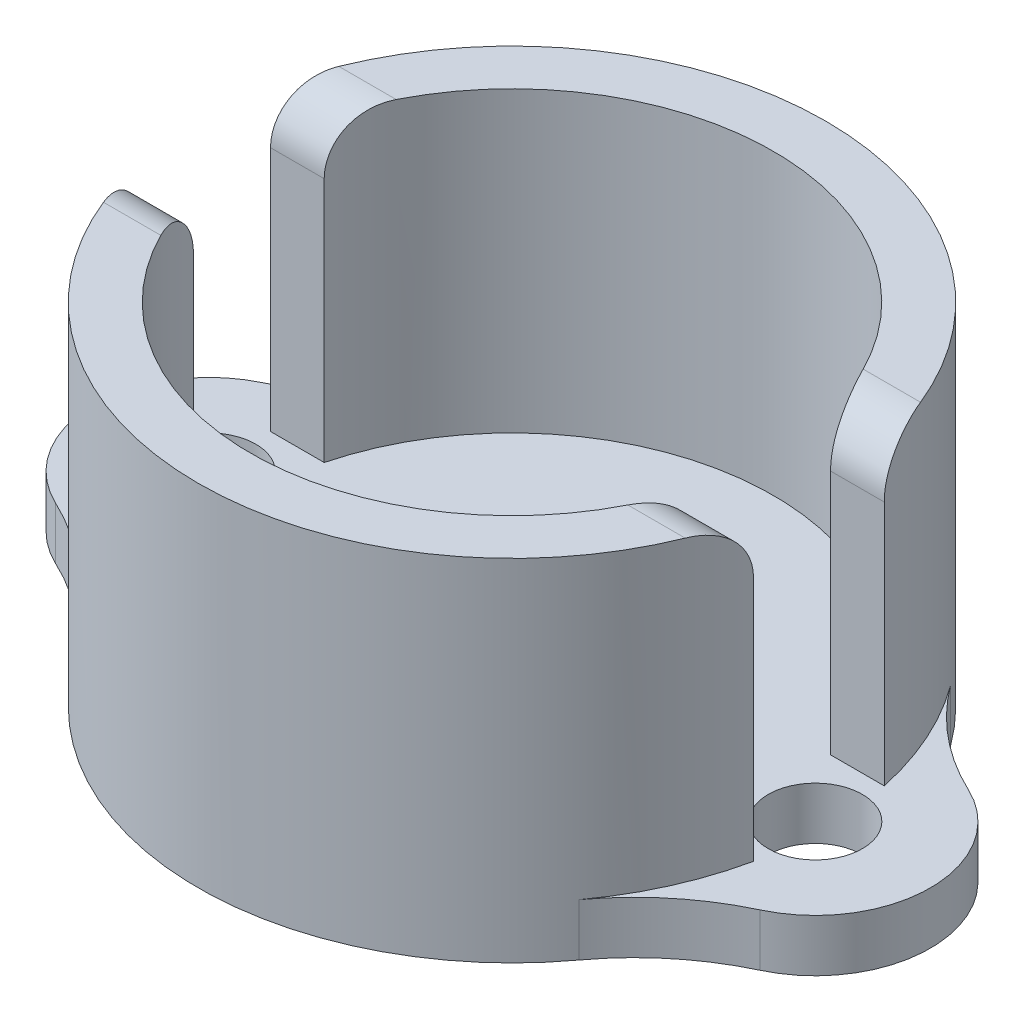
ISO-10303-21;
HEADER;
FILE_DESCRIPTION(('STEP AP214'),'2;1');
FILE_NAME('part.step','',(''),(''),'','','');
FILE_SCHEMA(('AUTOMOTIVE_DESIGN { 1 0 10303 214 1 1 1 1 }'));
ENDSEC;
DATA;
#1=APPLICATION_CONTEXT('core data for automotive mechanical design processes');
#2=APPLICATION_PROTOCOL_DEFINITION('international standard','automotive_design',2000,#1);
#3=PRODUCT_CONTEXT('',#1,'mechanical');
#4=PRODUCT('Part','Part','',(#3));
#5=PRODUCT_RELATED_PRODUCT_CATEGORY('part','',(#4));
#6=PRODUCT_DEFINITION_FORMATION('','',#4);
#7=PRODUCT_DEFINITION_CONTEXT('part definition',#1,'design');
#8=PRODUCT_DEFINITION('design','',#6,#7);
#9=PRODUCT_DEFINITION_SHAPE('','',#8);
#10=(LENGTH_UNIT() NAMED_UNIT(*) SI_UNIT(.MILLI.,.METRE.));
#11=(NAMED_UNIT(*) PLANE_ANGLE_UNIT() SI_UNIT($,.RADIAN.));
#12=(NAMED_UNIT(*) SI_UNIT($,.STERADIAN.) SOLID_ANGLE_UNIT());
#13=UNCERTAINTY_MEASURE_WITH_UNIT(LENGTH_MEASURE(1.E-05),#10,'distance_accuracy_value','');
#14=(GEOMETRIC_REPRESENTATION_CONTEXT(3) GLOBAL_UNCERTAINTY_ASSIGNED_CONTEXT((#13)) GLOBAL_UNIT_ASSIGNED_CONTEXT((#10,
#11,#12)) REPRESENTATION_CONTEXT('',''));
#15=CARTESIAN_POINT('',(0.,0.,0.));
#16=DIRECTION('',(0.,0.,1.));
#17=DIRECTION('',(1.,0.,0.));
#18=AXIS2_PLACEMENT_3D('',#15,#16,#17);
#19=CARTESIAN_POINT('',(-3.683,1.27,0.));
#20=DIRECTION('',(0.,1.,0.));
#21=DIRECTION('',(0.,0.,1.));
#22=AXIS2_PLACEMENT_3D('',#19,#20,#21);
#23=PLANE('',#22);
#24=CARTESIAN_POINT('',(-7.366,1.27,0.));
#25=DIRECTION('',(0.,1.,0.));
#26=DIRECTION('',(0.,0.,1.));
#27=AXIS2_PLACEMENT_3D('',#24,#25,#26);
#28=CIRCLE('',#27,1.143);
#29=CARTESIAN_POINT('',(-7.366,1.27,1.143));
#30=VERTEX_POINT('',#29);
#31=EDGE_CURVE('E247',#30,#30,#28,.T.);
#32=ORIENTED_EDGE('',*,*,#31,.F.);
#33=EDGE_LOOP('',(#32));
#34=FACE_BOUND('',#33,.T.);
#35=CARTESIAN_POINT('',(0.,1.27,0.));
#36=DIRECTION('',(0.,1.,0.));
#37=DIRECTION('',(0.,0.,1.));
#38=AXIS2_PLACEMENT_3D('',#35,#36,#37);
#39=CIRCLE('',#38,3.683);
#40=CARTESIAN_POINT('',(0.,1.27,3.683));
#41=VERTEX_POINT('',#40);
#42=EDGE_CURVE('E446',#41,#41,#39,.T.);
#43=ORIENTED_EDGE('',*,*,#42,.F.);
#44=EDGE_LOOP('',(#43));
#45=FACE_BOUND('',#44,.T.);
#46=CARTESIAN_POINT('',(7.366,1.27,0.));
#47=DIRECTION('',(0.,1.,0.));
#48=DIRECTION('',(0.,0.,1.));
#49=AXIS2_PLACEMENT_3D('',#46,#47,#48);
#50=CIRCLE('',#49,1.143);
#51=CARTESIAN_POINT('',(7.366,1.27,1.143));
#52=VERTEX_POINT('',#51);
#53=EDGE_CURVE('E437',#52,#52,#50,.T.);
#54=ORIENTED_EDGE('',*,*,#53,.F.);
#55=EDGE_LOOP('',(#54));
#56=FACE_BOUND('',#55,.T.);
#57=CARTESIAN_POINT('',(11.2548275862069,1.27,-8.27585379309931));
#58=DIRECTION('',(0.,1.,0.));
#59=DIRECTION('',(0.,0.,1.));
#60=AXIS2_PLACEMENT_3D('',#57,#58,#59);
#61=CIRCLE('',#60,6.35);
#62=CARTESIAN_POINT('',(8.55425287356322,1.27,-2.52873310344701));
#63=VERTEX_POINT('',#62);
#64=CARTESIAN_POINT('',(6.13899686520376,1.27,-4.51410206896326));
#65=VERTEX_POINT('',#64);
#66=EDGE_CURVE('E475',#63,#65,#61,.F.);
#67=ORIENTED_EDGE('',*,*,#66,.T.);
#68=CARTESIAN_POINT('',(0.,1.27,0.));
#69=DIRECTION('',(0.,1.,0.));
#70=DIRECTION('',(0.,0.,1.));
#71=AXIS2_PLACEMENT_3D('',#68,#69,#70);
#72=CIRCLE('',#71,7.62);
#73=CARTESIAN_POINT('',(7.45280106738399,1.27,-1.5875));
#74=VERTEX_POINT('',#73);
#75=EDGE_CURVE('E205',#74,#65,#72,.T.);
#76=ORIENTED_EDGE('',*,*,#75,.F.);
#77=DIRECTION('',(1.,0.,0.));
#78=VECTOR('',#77,1.);
#79=CARTESIAN_POINT('',(6.14836106210427,1.27,-1.5875));
#80=LINE('',#79,#78);
#81=CARTESIAN_POINT('',(6.14836106210427,1.27,-1.5875));
#82=VERTEX_POINT('',#81);
#83=EDGE_CURVE('E208',#82,#74,#80,.T.);
#84=ORIENTED_EDGE('',*,*,#83,.F.);
#85=CARTESIAN_POINT('',(0.,1.27,0.));
#86=DIRECTION('',(0.,1.,0.));
#87=DIRECTION('',(0.,0.,1.));
#88=AXIS2_PLACEMENT_3D('',#85,#86,#87);
#89=CIRCLE('',#88,6.35);
#90=CARTESIAN_POINT('',(-6.14836106210428,1.27,-1.58749999999999));
#91=VERTEX_POINT('',#90);
#92=EDGE_CURVE('E209',#82,#91,#89,.T.);
#93=ORIENTED_EDGE('',*,*,#92,.T.);
#94=DIRECTION('',(1.,0.,0.));
#95=VECTOR('',#94,1.);
#96=CARTESIAN_POINT('',(-7.45280106738399,1.27,-1.5875));
#97=LINE('',#96,#95);
#98=CARTESIAN_POINT('',(-7.45280106738399,1.27,-1.5875));
#99=VERTEX_POINT('',#98);
#100=EDGE_CURVE('E204',#99,#91,#97,.T.);
#101=ORIENTED_EDGE('',*,*,#100,.F.);
#102=CARTESIAN_POINT('',(-6.13899686520376,1.27,-4.51410206896326));
#103=VERTEX_POINT('',#102);
#104=EDGE_CURVE('E194',#103,#99,#72,.T.);
#105=ORIENTED_EDGE('',*,*,#104,.F.);
#106=CARTESIAN_POINT('',(-11.2548275862069,1.27,-8.27585379309931));
#107=DIRECTION('',(0.,1.,0.));
#108=DIRECTION('',(0.,0.,1.));
#109=AXIS2_PLACEMENT_3D('',#106,#107,#108);
#110=CIRCLE('',#109,6.35);
#111=CARTESIAN_POINT('',(-8.55425287356322,1.27,-2.52873310344701));
#112=VERTEX_POINT('',#111);
#113=EDGE_CURVE('E175',#103,#112,#110,.F.);
#114=ORIENTED_EDGE('',*,*,#113,.T.);
#115=CARTESIAN_POINT('',(-7.366,1.27,0.));
#116=DIRECTION('',(0.,1.,0.));
#117=DIRECTION('',(0.,0.,1.));
#118=AXIS2_PLACEMENT_3D('',#115,#116,#117);
#119=CIRCLE('',#118,2.794);
#120=CARTESIAN_POINT('',(-8.55425287356322,1.27,2.52873310344701));
#121=VERTEX_POINT('',#120);
#122=EDGE_CURVE('E451',#112,#121,#119,.T.);
#123=ORIENTED_EDGE('',*,*,#122,.T.);
#124=CARTESIAN_POINT('',(-11.2548275862069,1.27,8.27585379309932));
#125=DIRECTION('',(0.,1.,0.));
#126=DIRECTION('',(0.,0.,1.));
#127=AXIS2_PLACEMENT_3D('',#124,#125,#126);
#128=CIRCLE('',#127,6.35);
#129=CARTESIAN_POINT('',(-6.13899686520376,1.27,4.51410206896326));
#130=VERTEX_POINT('',#129);
#131=EDGE_CURVE('E254',#121,#130,#128,.F.);
#132=ORIENTED_EDGE('',*,*,#131,.T.);
#133=CARTESIAN_POINT('',(0.,1.27,0.));
#134=DIRECTION('',(0.,1.,0.));
#135=DIRECTION('',(0.,0.,1.));
#136=AXIS2_PLACEMENT_3D('',#133,#134,#135);
#137=CIRCLE('',#136,7.62);
#138=CARTESIAN_POINT('',(-7.45280106738399,1.27,1.5875));
#139=VERTEX_POINT('',#138);
#140=EDGE_CURVE('E234',#139,#130,#137,.T.);
#141=ORIENTED_EDGE('',*,*,#140,.F.);
#142=DIRECTION('',(1.,0.,0.));
#143=VECTOR('',#142,1.);
#144=CARTESIAN_POINT('',(0.,1.27,1.58749999999997));
#145=LINE('',#144,#143);
#146=CARTESIAN_POINT('',(-6.14836106210428,1.27,1.58749999999999));
#147=VERTEX_POINT('',#146);
#148=EDGE_CURVE('E231',#139,#147,#145,.T.);
#149=ORIENTED_EDGE('',*,*,#148,.T.);
#150=CARTESIAN_POINT('',(0.,1.27,0.));
#151=DIRECTION('',(0.,1.,0.));
#152=DIRECTION('',(0.,0.,1.));
#153=AXIS2_PLACEMENT_3D('',#150,#151,#152);
#154=CIRCLE('',#153,6.35);
#155=CARTESIAN_POINT('',(6.14836106210428,1.27,1.58749999999999));
#156=VERTEX_POINT('',#155);
#157=EDGE_CURVE('E215',#147,#156,#154,.T.);
#158=ORIENTED_EDGE('',*,*,#157,.T.);
#159=DIRECTION('',(1.,0.,0.));
#160=VECTOR('',#159,1.);
#161=CARTESIAN_POINT('',(0.,1.27,1.58750000000001));
#162=LINE('',#161,#160);
#163=CARTESIAN_POINT('',(7.452801067384,1.27,1.58749999999999));
#164=VERTEX_POINT('',#163);
#165=EDGE_CURVE('E226',#156,#164,#162,.T.);
#166=ORIENTED_EDGE('',*,*,#165,.T.);
#167=CARTESIAN_POINT('',(6.13899686520376,1.27,4.51410206896326));
#168=VERTEX_POINT('',#167);
#169=EDGE_CURVE('E258',#168,#164,#137,.T.);
#170=ORIENTED_EDGE('',*,*,#169,.F.);
#171=CARTESIAN_POINT('',(11.2548275862069,1.27,8.27585379309931));
#172=DIRECTION('',(0.,1.,0.));
#173=DIRECTION('',(0.,0.,1.));
#174=AXIS2_PLACEMENT_3D('',#171,#172,#173);
#175=CIRCLE('',#174,6.35);
#176=CARTESIAN_POINT('',(8.55425287356322,1.27,2.52873310344701));
#177=VERTEX_POINT('',#176);
#178=EDGE_CURVE('E263',#168,#177,#175,.F.);
#179=ORIENTED_EDGE('',*,*,#178,.T.);
#180=CARTESIAN_POINT('',(7.366,1.27,0.));
#181=DIRECTION('',(0.,1.,0.));
#182=DIRECTION('',(0.,0.,1.));
#183=AXIS2_PLACEMENT_3D('',#180,#181,#182);
#184=CIRCLE('',#183,2.794);
#185=EDGE_CURVE('E199',#177,#63,#184,.T.);
#186=ORIENTED_EDGE('',*,*,#185,.T.);
#187=EDGE_LOOP('',(#67,#76,#84,#93,#101,#105,#114,#123,#132,#141,#149,#158,#166,#170,#179,#186));
#188=FACE_BOUND('',#187,.T.);
#189=ADVANCED_FACE('F35',(#34,#45,#56,#188),#23,.T.);
#190=CARTESIAN_POINT('',(-3.683,0.,0.));
#191=DIRECTION('',(0.,1.,0.));
#192=DIRECTION('',(0.,0.,1.));
#193=AXIS2_PLACEMENT_3D('',#190,#191,#192);
#194=PLANE('',#193);
#195=CARTESIAN_POINT('',(7.366,0.,0.));
#196=DIRECTION('',(0.,1.,0.));
#197=DIRECTION('',(0.,0.,1.));
#198=AXIS2_PLACEMENT_3D('',#195,#196,#197);
#199=CIRCLE('',#198,1.143);
#200=CARTESIAN_POINT('',(7.366,0.,1.143));
#201=VERTEX_POINT('',#200);
#202=EDGE_CURVE('E440',#201,#201,#199,.T.);
#203=ORIENTED_EDGE('',*,*,#202,.T.);
#204=EDGE_LOOP('',(#203));
#205=FACE_BOUND('',#204,.T.);
#206=CARTESIAN_POINT('',(0.,0.,0.));
#207=DIRECTION('',(0.,1.,0.));
#208=DIRECTION('',(0.,0.,1.));
#209=AXIS2_PLACEMENT_3D('',#206,#207,#208);
#210=CIRCLE('',#209,7.62);
#211=CARTESIAN_POINT('',(6.13899686520376,0.,-4.51410206896326));
#212=VERTEX_POINT('',#211);
#213=CARTESIAN_POINT('',(-6.13899686520376,0.,-4.51410206896326));
#214=VERTEX_POINT('',#213);
#215=EDGE_CURVE('E197',#212,#214,#210,.T.);
#216=ORIENTED_EDGE('',*,*,#215,.F.);
#217=CARTESIAN_POINT('',(11.2548275862069,0.,-8.27585379309931));
#218=DIRECTION('',(0.,1.,0.));
#219=DIRECTION('',(0.,0.,1.));
#220=AXIS2_PLACEMENT_3D('',#217,#218,#219);
#221=CIRCLE('',#220,6.35);
#222=CARTESIAN_POINT('',(8.55425287356322,0.,-2.52873310344701));
#223=VERTEX_POINT('',#222);
#224=EDGE_CURVE('E473',#212,#223,#221,.T.);
#225=ORIENTED_EDGE('',*,*,#224,.T.);
#226=CARTESIAN_POINT('',(7.366,0.,0.));
#227=DIRECTION('',(0.,1.,0.));
#228=DIRECTION('',(0.,0.,1.));
#229=AXIS2_PLACEMENT_3D('',#226,#227,#228);
#230=CIRCLE('',#229,2.794);
#231=CARTESIAN_POINT('',(8.55425287356322,0.,2.52873310344701));
#232=VERTEX_POINT('',#231);
#233=EDGE_CURVE('E453',#232,#223,#230,.T.);
#234=ORIENTED_EDGE('',*,*,#233,.F.);
#235=CARTESIAN_POINT('',(11.2548275862069,0.,8.27585379309931));
#236=DIRECTION('',(0.,1.,0.));
#237=DIRECTION('',(0.,0.,1.));
#238=AXIS2_PLACEMENT_3D('',#235,#236,#237);
#239=CIRCLE('',#238,6.35);
#240=CARTESIAN_POINT('',(6.13899686520376,0.,4.51410206896326));
#241=VERTEX_POINT('',#240);
#242=EDGE_CURVE('E252',#232,#241,#239,.T.);
#243=ORIENTED_EDGE('',*,*,#242,.T.);
#244=CARTESIAN_POINT('',(0.,0.,0.));
#245=DIRECTION('',(0.,1.,0.));
#246=DIRECTION('',(0.,0.,1.));
#247=AXIS2_PLACEMENT_3D('',#244,#245,#246);
#248=CIRCLE('',#247,7.62);
#249=CARTESIAN_POINT('',(-6.13899686520376,0.,4.51410206896326));
#250=VERTEX_POINT('',#249);
#251=EDGE_CURVE('E460',#250,#241,#248,.T.);
#252=ORIENTED_EDGE('',*,*,#251,.F.);
#253=CARTESIAN_POINT('',(-11.2548275862069,0.,8.27585379309932));
#254=DIRECTION('',(0.,1.,0.));
#255=DIRECTION('',(0.,0.,1.));
#256=AXIS2_PLACEMENT_3D('',#253,#254,#255);
#257=CIRCLE('',#256,6.35);
#258=CARTESIAN_POINT('',(-8.55425287356322,0.,2.52873310344701));
#259=VERTEX_POINT('',#258);
#260=EDGE_CURVE('E185',#250,#259,#257,.T.);
#261=ORIENTED_EDGE('',*,*,#260,.T.);
#262=CARTESIAN_POINT('',(-7.366,0.,0.));
#263=DIRECTION('',(0.,1.,0.));
#264=DIRECTION('',(0.,0.,1.));
#265=AXIS2_PLACEMENT_3D('',#262,#263,#264);
#266=CIRCLE('',#265,2.794);
#267=CARTESIAN_POINT('',(-8.55425287356322,0.,-2.52873310344701));
#268=VERTEX_POINT('',#267);
#269=EDGE_CURVE('E457',#268,#259,#266,.T.);
#270=ORIENTED_EDGE('',*,*,#269,.F.);
#271=CARTESIAN_POINT('',(-11.2548275862069,0.,-8.27585379309931));
#272=DIRECTION('',(0.,1.,0.));
#273=DIRECTION('',(0.,0.,1.));
#274=AXIS2_PLACEMENT_3D('',#271,#272,#273);
#275=CIRCLE('',#274,6.35);
#276=EDGE_CURVE('E186',#268,#214,#275,.T.);
#277=ORIENTED_EDGE('',*,*,#276,.T.);
#278=EDGE_LOOP('',(#216,#225,#234,#243,#252,#261,#270,#277));
#279=FACE_BOUND('',#278,.T.);
#280=CARTESIAN_POINT('',(0.,0.,0.));
#281=DIRECTION('',(0.,1.,0.));
#282=DIRECTION('',(0.,0.,1.));
#283=AXIS2_PLACEMENT_3D('',#280,#281,#282);
#284=CIRCLE('',#283,3.683);
#285=CARTESIAN_POINT('',(0.,0.,3.683));
#286=VERTEX_POINT('',#285);
#287=EDGE_CURVE('E442',#286,#286,#284,.T.);
#288=ORIENTED_EDGE('',*,*,#287,.T.);
#289=EDGE_LOOP('',(#288));
#290=FACE_BOUND('',#289,.T.);
#291=CARTESIAN_POINT('',(-7.366,0.,0.));
#292=DIRECTION('',(0.,1.,0.));
#293=DIRECTION('',(0.,0.,1.));
#294=AXIS2_PLACEMENT_3D('',#291,#292,#293);
#295=CIRCLE('',#294,1.143);
#296=CARTESIAN_POINT('',(-7.366,0.,1.143));
#297=VERTEX_POINT('',#296);
#298=EDGE_CURVE('E244',#297,#297,#295,.T.);
#299=ORIENTED_EDGE('',*,*,#298,.T.);
#300=EDGE_LOOP('',(#299));
#301=FACE_BOUND('',#300,.T.);
#302=ADVANCED_FACE('F297',(#205,#279,#290,#301),#194,.F.);
#303=CARTESIAN_POINT('',(0.,1.27,0.));
#304=DIRECTION('',(0.,-1.,0.));
#305=DIRECTION('',(0.,0.,-1.));
#306=AXIS2_PLACEMENT_3D('',#303,#304,#305);
#307=CYLINDRICAL_SURFACE('',#306,7.62);
#308=CARTESIAN_POINT('',(0.,8.509,0.));
#309=DIRECTION('',(0.,1.,0.));
#310=DIRECTION('',(0.,0.,1.));
#311=AXIS2_PLACEMENT_3D('',#308,#309,#310);
#312=CIRCLE('',#311,7.62);
#313=CARTESIAN_POINT('',(7.06392905895862,8.509,-2.8575));
#314=VERTEX_POINT('',#313);
#315=CARTESIAN_POINT('',(-7.06392905895862,8.509,-2.85749999999999));
#316=VERTEX_POINT('',#315);
#317=EDGE_CURVE('E219',#314,#316,#312,.T.);
#318=ORIENTED_EDGE('',*,*,#317,.F.);
#319=CARTESIAN_POINT('',(7.06392905895862,8.509,-2.8575));
#320=CARTESIAN_POINT('',(7.07843736501877,8.50899859697971,-2.82163825553866));
#321=CARTESIAN_POINT('',(7.09266425982096,8.50747985011255,-2.78567800224506));
#322=CARTESIAN_POINT('',(7.12048916218544,8.50135697671411,-2.71376467872221));
#323=CARTESIAN_POINT('',(7.1340869700201,8.49675187739204,-2.67781161433392));
#324=CARTESIAN_POINT('',(7.17384653840688,8.47822192458955,-2.57024314313524));
#325=CARTESIAN_POINT('',(7.1989496263898,8.45958224394944,-2.49897993959324));
#326=CARTESIAN_POINT('',(7.24581697814305,8.40970113047067,-2.35965338991237));
#327=CARTESIAN_POINT('',(7.26757335417695,8.37843053817125,-2.29159785770188));
#328=CARTESIAN_POINT('',(7.30737257096271,8.30383116144181,-2.16132829728701));
#329=CARTESIAN_POINT('',(7.32541997280119,8.26051734328004,-2.09910714614017));
#330=CARTESIAN_POINT('',(7.35693612217495,8.16536257250944,-1.98574626421512));
#331=CARTESIAN_POINT('',(7.37058889264291,8.11405722942216,-1.93420764983321));
#332=CARTESIAN_POINT('',(7.39458789916548,8.00291075860134,-1.84033262818981));
#333=CARTESIAN_POINT('',(7.40493326330446,7.94306738603174,-1.79799864844126));
#334=CARTESIAN_POINT('',(7.42216152944143,7.81899492643034,-1.72547428617237));
#335=CARTESIAN_POINT('',(7.42915807530186,7.75500904264314,-1.69489356304227));
#336=CARTESIAN_POINT('',(7.44041559922906,7.62265496665965,-1.64477389442931));
#337=CARTESIAN_POINT('',(7.44467908969662,7.55429086298972,-1.62522480993771));
#338=CARTESIAN_POINT('',(7.44937372750874,7.44431655525348,-1.60352567223856));
#339=CARTESIAN_POINT('',(7.45066182149117,7.40346369604353,-1.59751867061972));
#340=CARTESIAN_POINT('',(7.45237357966,7.32141352567955,-1.58950750831548));
#341=CARTESIAN_POINT('',(7.45279858228485,7.28021684748784,-1.58749714993986));
#342=CARTESIAN_POINT('',(7.45280106738399,7.239,-1.5875));
#343=B_SPLINE_CURVE_WITH_KNOTS('',3,(#319,#320,#321,#322,#323,#324,#325,#326,#327,#328,#329,
#330,#331,#332,#333,#334,#335,#336,#337,#338,#339,#340,#341,#342),.UNSPECIFIED.,.F.,.F.,(4,2,2,
2,2,2,2,2,2,2,2,4),(0.,0.115994134719368,0.232024846961281,0.464282767346287,0.697079966337561,
0.929589148477001,1.15045536787084,1.37137976524223,1.58415488760861,1.7967341318015,
1.92048585489263,2.04404552306935),.UNSPECIFIED.);
#344=CARTESIAN_POINT('',(7.45280106738399,7.239,-1.5875));
#345=VERTEX_POINT('',#344);
#346=EDGE_CURVE('E286',#314,#345,#343,.T.);
#347=ORIENTED_EDGE('',*,*,#346,.T.);
#348=DIRECTION('',(0.,-1.,0.));
#349=VECTOR('',#348,1.);
#350=CARTESIAN_POINT('',(7.45280106738399,8.509,-1.5875));
#351=LINE('',#350,#349);
#352=EDGE_CURVE('E493',#345,#74,#351,.T.);
#353=ORIENTED_EDGE('',*,*,#352,.T.);
#354=ORIENTED_EDGE('',*,*,#75,.T.);
#355=DIRECTION('',(0.,-1.,0.));
#356=VECTOR('',#355,1.);
#357=CARTESIAN_POINT('',(6.13899686520376,1.27,-4.51410206896326));
#358=LINE('',#357,#356);
#359=EDGE_CURVE('E198',#65,#212,#358,.T.);
#360=ORIENTED_EDGE('',*,*,#359,.T.);
#361=ORIENTED_EDGE('',*,*,#215,.T.);
#362=DIRECTION('',(0.,-1.,0.));
#363=VECTOR('',#362,1.);
#364=CARTESIAN_POINT('',(-6.13899686520376,1.27,-4.51410206896326));
#365=LINE('',#364,#363);
#366=EDGE_CURVE('E178',#214,#103,#365,.F.);
#367=ORIENTED_EDGE('',*,*,#366,.T.);
#368=ORIENTED_EDGE('',*,*,#104,.T.);
#369=DIRECTION('',(0.,-1.,0.));
#370=VECTOR('',#369,1.);
#371=CARTESIAN_POINT('',(-7.45280106738399,8.509,-1.5875));
#372=LINE('',#371,#370);
#373=CARTESIAN_POINT('',(-7.45280106738399,7.239,-1.5875));
#374=VERTEX_POINT('',#373);
#375=EDGE_CURVE('E500',#374,#99,#372,.T.);
#376=ORIENTED_EDGE('',*,*,#375,.F.);
#377=CARTESIAN_POINT('',(-7.45280106738399,7.239,-1.5875));
#378=CARTESIAN_POINT('',(-7.45279966706115,7.27401616379087,-1.58749986861932));
#379=CARTESIAN_POINT('',(-7.45249254849033,7.30901550318563,-1.5889491467192));
#380=CARTESIAN_POINT('',(-7.45125856032225,7.37876240459834,-1.59472842631202));
#381=CARTESIAN_POINT('',(-7.450331727378,7.41350998138393,-1.59905825743455));
#382=CARTESIAN_POINT('',(-7.44661391460367,7.5169211392596,-1.61631949826543));
#383=CARTESIAN_POINT('',(-7.44288567498364,7.58488973641644,-1.63352281496697));
#384=CARTESIAN_POINT('',(-7.43280826791649,7.71690123929467,-1.67877694672967));
#385=CARTESIAN_POINT('',(-7.42645796146656,7.7809424250807,-1.70683247556143));
#386=CARTESIAN_POINT('',(-7.41096986173545,7.90331169750437,-1.77287090150378));
#387=CARTESIAN_POINT('',(-7.40183239496002,7.96164045227587,-1.8108526357207));
#388=CARTESIAN_POINT('',(-7.38057053437023,8.07120339826314,-1.89565024614752));
#389=CARTESIAN_POINT('',(-7.36843521590413,8.1224105459363,-1.94249828318606));
#390=CARTESIAN_POINT('',(-7.34109530826738,8.21617415422318,-2.04339079684467));
#391=CARTESIAN_POINT('',(-7.32589065307877,8.25873042872692,-2.09743542824679));
#392=CARTESIAN_POINT('',(-7.29212304639323,8.33492636964945,-2.21200495342799));
#393=CARTESIAN_POINT('',(-7.27350483884338,8.36839274037238,-2.27262855051727));
#394=CARTESIAN_POINT('',(-7.2332485484701,8.42481844381205,-2.39767188661911));
#395=CARTESIAN_POINT('',(-7.21160912505282,8.44777309273929,-2.46209330345337));
#396=CARTESIAN_POINT('',(-7.16950521961749,8.48000263290244,-2.58184252629838));
#397=CARTESIAN_POINT('',(-7.1494531385728,8.49092691066544,-2.63688180500072));
#398=CARTESIAN_POINT('',(-7.10779657883283,8.50542550002576,-2.74720867195128));
#399=CARTESIAN_POINT('',(-7.08619547716443,8.50901532581593,-2.80249548764349));
#400=CARTESIAN_POINT('',(-7.06392905895862,8.509,-2.85749999999999));
#401=B_SPLINE_CURVE_WITH_KNOTS('',3,(#377,#378,#379,#380,#381,#382,#383,#384,#385,#386,#387,
#388,#389,#390,#391,#392,#393,#394,#395,#396,#397,#398,#399,#400),.UNSPECIFIED.,.F.,.F.,(4,2,2,
2,2,2,2,2,2,2,2,4),(0.,0.104983767306209,0.209961325896023,0.419511911224194,0.629153619411336,
0.838770778256326,1.04916338514017,1.25956051781222,1.47372482633002,1.68798446907142,
1.8662822514444,2.04420249749541),.UNSPECIFIED.);
#402=EDGE_CURVE('E280',#374,#316,#401,.T.);
#403=ORIENTED_EDGE('',*,*,#402,.T.);
#404=EDGE_LOOP('',(#318,#347,#353,#354,#360,#361,#367,#368,#376,#403));
#405=FACE_BOUND('',#404,.T.);
#406=ADVANCED_FACE('F192',(#405),#307,.T.);
#407=CARTESIAN_POINT('',(-7.366,1.27,0.));
#408=DIRECTION('',(0.,-1.,0.));
#409=DIRECTION('',(0.,0.,-1.));
#410=AXIS2_PLACEMENT_3D('',#407,#408,#409);
#411=CYLINDRICAL_SURFACE('',#410,2.794);
#412=ORIENTED_EDGE('',*,*,#122,.F.);
#413=DIRECTION('',(0.,-1.,0.));
#414=VECTOR('',#413,1.);
#415=CARTESIAN_POINT('',(-8.55425287356322,1.27,-2.52873310344701));
#416=LINE('',#415,#414);
#417=EDGE_CURVE('E180',#112,#268,#416,.T.);
#418=ORIENTED_EDGE('',*,*,#417,.T.);
#419=ORIENTED_EDGE('',*,*,#269,.T.);
#420=DIRECTION('',(0.,-1.,0.));
#421=VECTOR('',#420,1.);
#422=CARTESIAN_POINT('',(-8.55425287356322,1.27,2.52873310344701));
#423=LINE('',#422,#421);
#424=EDGE_CURVE('E470',#259,#121,#423,.F.);
#425=ORIENTED_EDGE('',*,*,#424,.T.);
#426=EDGE_LOOP('',(#412,#418,#419,#425));
#427=FACE_BOUND('',#426,.T.);
#428=ADVANCED_FACE('F296',(#427),#411,.T.);
#429=CARTESIAN_POINT('',(0.,1.27,0.));
#430=DIRECTION('',(0.,-1.,0.));
#431=DIRECTION('',(0.,0.,-1.));
#432=AXIS2_PLACEMENT_3D('',#429,#430,#431);
#433=CYLINDRICAL_SURFACE('',#432,7.62);
#434=DIRECTION('',(0.,-1.,0.));
#435=VECTOR('',#434,1.);
#436=CARTESIAN_POINT('',(7.452801067384,8.509,1.58749999999999));
#437=LINE('',#436,#435);
#438=CARTESIAN_POINT('',(7.452801067384,7.239,1.58749999999999));
#439=VERTEX_POINT('',#438);
#440=EDGE_CURVE('E238',#439,#164,#437,.T.);
#441=ORIENTED_EDGE('',*,*,#440,.F.);
#442=CARTESIAN_POINT('',(7.452801067384,7.239,1.58749999999999));
#443=CARTESIAN_POINT('',(7.45279966706115,7.27401616379087,1.58749986861931));
#444=CARTESIAN_POINT('',(7.45249254849033,7.30901550318563,1.5889491467192));
#445=CARTESIAN_POINT('',(7.45125856032226,7.37876240459834,1.59472842631202));
#446=CARTESIAN_POINT('',(7.450331727378,7.41350998138393,1.59905825743455));
#447=CARTESIAN_POINT('',(7.44661391460367,7.5169211392596,1.61631949826542));
#448=CARTESIAN_POINT('',(7.44288567498364,7.58488973641644,1.63352281496696));
#449=CARTESIAN_POINT('',(7.43280826791649,7.71690123929466,1.67877694672967));
#450=CARTESIAN_POINT('',(7.42645796146656,7.7809424250807,1.70683247556142));
#451=CARTESIAN_POINT('',(7.41096986173545,7.90331169750437,1.77287090150377));
#452=CARTESIAN_POINT('',(7.40183239496002,7.96164045227586,1.8108526357207));
#453=CARTESIAN_POINT('',(7.38057053437023,8.07120339826314,1.89565024614751));
#454=CARTESIAN_POINT('',(7.36843521590413,8.1224105459363,1.94249828318605));
#455=CARTESIAN_POINT('',(7.34109530826738,8.21617415422318,2.04339079684466));
#456=CARTESIAN_POINT('',(7.32589065307878,8.25873042872692,2.09743542824679));
#457=CARTESIAN_POINT('',(7.29212304639323,8.33492636964944,2.21200495342799));
#458=CARTESIAN_POINT('',(7.27350483884339,8.36839274037238,2.27262855051726));
#459=CARTESIAN_POINT('',(7.2332485484701,8.42481844381205,2.3976718866191));
#460=CARTESIAN_POINT('',(7.21160912505283,8.44777309273929,2.46209330345337));
#461=CARTESIAN_POINT('',(7.16950521961749,8.48000263290244,2.58184252629837));
#462=CARTESIAN_POINT('',(7.14945313857281,8.49092691066544,2.63688180500072));
#463=CARTESIAN_POINT('',(7.10779657883283,8.50542550002576,2.74720867195127));
#464=CARTESIAN_POINT('',(7.08619547716443,8.50901532581593,2.80249548764349));
#465=CARTESIAN_POINT('',(7.06392905895862,8.509,2.85749999999999));
#466=B_SPLINE_CURVE_WITH_KNOTS('',3,(#442,#443,#444,#445,#446,#447,#448,#449,#450,#451,#452,
#453,#454,#455,#456,#457,#458,#459,#460,#461,#462,#463,#464,#465),.UNSPECIFIED.,.F.,.F.,(4,2,2,
2,2,2,2,2,2,2,2,4),(0.,0.104983767306208,0.209961325896021,0.419511911224193,0.629153619411332,
0.838770778256324,1.04916338514017,1.25956051781222,1.47372482633002,1.68798446907142,
1.8662822514444,2.04420249749541),.UNSPECIFIED.);
#467=CARTESIAN_POINT('',(7.06392905895862,8.509,2.85749999999999));
#468=VERTEX_POINT('',#467);
#469=EDGE_CURVE('E397',#439,#468,#466,.T.);
#470=ORIENTED_EDGE('',*,*,#469,.T.);
#471=CARTESIAN_POINT('',(0.,8.509,0.));
#472=DIRECTION('',(0.,1.,0.));
#473=DIRECTION('',(0.,0.,1.));
#474=AXIS2_PLACEMENT_3D('',#471,#472,#473);
#475=CIRCLE('',#474,7.62);
#476=CARTESIAN_POINT('',(-7.06392905895862,8.509,2.8575));
#477=VERTEX_POINT('',#476);
#478=EDGE_CURVE('E225',#477,#468,#475,.T.);
#479=ORIENTED_EDGE('',*,*,#478,.F.);
#480=CARTESIAN_POINT('',(-7.06392905895862,8.509,2.8575));
#481=CARTESIAN_POINT('',(-7.07843736501877,8.50899859697971,2.82163825553866));
#482=CARTESIAN_POINT('',(-7.09266425982096,8.50747985011255,2.78567800224506));
#483=CARTESIAN_POINT('',(-7.12048916218544,8.50135697671411,2.71376467872221));
#484=CARTESIAN_POINT('',(-7.1340869700201,8.49675187739204,2.67781161433392));
#485=CARTESIAN_POINT('',(-7.17384653840688,8.47822192458955,2.57024314313524));
#486=CARTESIAN_POINT('',(-7.1989496263898,8.45958224394944,2.49897993959324));
#487=CARTESIAN_POINT('',(-7.24581697814305,8.40970113047067,2.35965338991237));
#488=CARTESIAN_POINT('',(-7.26757335417695,8.37843053817125,2.29159785770189));
#489=CARTESIAN_POINT('',(-7.30737257096271,8.30383116144181,2.16132829728701));
#490=CARTESIAN_POINT('',(-7.32541997280119,8.26051734328004,2.09910714614018));
#491=CARTESIAN_POINT('',(-7.35693612217495,8.16536257250944,1.98574626421513));
#492=CARTESIAN_POINT('',(-7.37058889264291,8.11405722942216,1.93420764983322));
#493=CARTESIAN_POINT('',(-7.39458789916548,8.00291075860134,1.84033262818982));
#494=CARTESIAN_POINT('',(-7.40493326330446,7.94306738603174,1.79799864844127));
#495=CARTESIAN_POINT('',(-7.42216152944143,7.81899492643034,1.72547428617237));
#496=CARTESIAN_POINT('',(-7.42915807530186,7.75500904264314,1.69489356304227));
#497=CARTESIAN_POINT('',(-7.44041559922906,7.62265496665965,1.64477389442932));
#498=CARTESIAN_POINT('',(-7.44467908969662,7.55429086298972,1.62522480993771));
#499=CARTESIAN_POINT('',(-7.44937372750874,7.44431655525348,1.60352567223856));
#500=CARTESIAN_POINT('',(-7.45066182149117,7.40346369604353,1.59751867061973));
#501=CARTESIAN_POINT('',(-7.45237357966,7.32141352567955,1.58950750831548));
#502=CARTESIAN_POINT('',(-7.45279858228485,7.28021684748784,1.58749714993986));
#503=CARTESIAN_POINT('',(-7.45280106738399,7.239,1.5875));
#504=B_SPLINE_CURVE_WITH_KNOTS('',3,(#480,#481,#482,#483,#484,#485,#486,#487,#488,#489,#490,
#491,#492,#493,#494,#495,#496,#497,#498,#499,#500,#501,#502,#503),.UNSPECIFIED.,.F.,.F.,(4,2,2,
2,2,2,2,2,2,2,2,4),(0.,0.115994134719367,0.232024846961281,0.464282767346286,0.69707996633756,
0.929589148476999,1.15045536787084,1.37137976524222,1.58415488760861,1.7967341318015,
1.92048585489263,2.04404552306935),.UNSPECIFIED.);
#505=CARTESIAN_POINT('',(-7.45280106738399,7.239,1.5875));
#506=VERTEX_POINT('',#505);
#507=EDGE_CURVE('E396',#477,#506,#504,.T.);
#508=ORIENTED_EDGE('',*,*,#507,.T.);
#509=DIRECTION('',(0.,-1.,0.));
#510=VECTOR('',#509,1.);
#511=CARTESIAN_POINT('',(-7.45280106738399,8.509,1.5875));
#512=LINE('',#511,#510);
#513=EDGE_CURVE('E240',#506,#139,#512,.T.);
#514=ORIENTED_EDGE('',*,*,#513,.T.);
#515=ORIENTED_EDGE('',*,*,#140,.T.);
#516=DIRECTION('',(0.,-1.,0.));
#517=VECTOR('',#516,1.);
#518=CARTESIAN_POINT('',(-6.13899686520376,1.27,4.51410206896326));
#519=LINE('',#518,#517);
#520=EDGE_CURVE('E269',#130,#250,#519,.T.);
#521=ORIENTED_EDGE('',*,*,#520,.T.);
#522=ORIENTED_EDGE('',*,*,#251,.T.);
#523=DIRECTION('',(0.,-1.,0.));
#524=VECTOR('',#523,1.);
#525=CARTESIAN_POINT('',(6.13899686520376,1.27,4.51410206896326));
#526=LINE('',#525,#524);
#527=EDGE_CURVE('E266',#241,#168,#526,.F.);
#528=ORIENTED_EDGE('',*,*,#527,.T.);
#529=ORIENTED_EDGE('',*,*,#169,.T.);
#530=EDGE_LOOP('',(#441,#470,#479,#508,#514,#515,#521,#522,#528,#529));
#531=FACE_BOUND('',#530,.T.);
#532=ADVANCED_FACE('F392',(#531),#433,.T.);
#533=CARTESIAN_POINT('',(7.366,1.27,0.));
#534=DIRECTION('',(0.,-1.,0.));
#535=DIRECTION('',(0.,0.,-1.));
#536=AXIS2_PLACEMENT_3D('',#533,#534,#535);
#537=CYLINDRICAL_SURFACE('',#536,2.794);
#538=ORIENTED_EDGE('',*,*,#233,.T.);
#539=DIRECTION('',(0.,-1.,0.));
#540=VECTOR('',#539,1.);
#541=CARTESIAN_POINT('',(8.55425287356322,1.27,-2.52873310344702));
#542=LINE('',#541,#540);
#543=EDGE_CURVE('E468',#223,#63,#542,.F.);
#544=ORIENTED_EDGE('',*,*,#543,.T.);
#545=ORIENTED_EDGE('',*,*,#185,.F.);
#546=DIRECTION('',(0.,-1.,0.));
#547=VECTOR('',#546,1.);
#548=CARTESIAN_POINT('',(8.55425287356322,1.27,2.52873310344701));
#549=LINE('',#548,#547);
#550=EDGE_CURVE('E465',#177,#232,#549,.T.);
#551=ORIENTED_EDGE('',*,*,#550,.T.);
#552=EDGE_LOOP('',(#538,#544,#545,#551));
#553=FACE_BOUND('',#552,.T.);
#554=ADVANCED_FACE('F413',(#553),#537,.T.);
#555=CARTESIAN_POINT('',(0.,1.27,0.));
#556=DIRECTION('',(0.,-1.,0.));
#557=DIRECTION('',(0.,0.,-1.));
#558=AXIS2_PLACEMENT_3D('',#555,#556,#557);
#559=CYLINDRICAL_SURFACE('',#558,3.683);
#560=ORIENTED_EDGE('',*,*,#42,.T.);
#561=EDGE_LOOP('',(#560));
#562=FACE_BOUND('',#561,.T.);
#563=ORIENTED_EDGE('',*,*,#287,.F.);
#564=EDGE_LOOP('',(#563));
#565=FACE_BOUND('',#564,.T.);
#566=ADVANCED_FACE('F417',(#562,#565),#559,.F.);
#567=CARTESIAN_POINT('',(7.366,1.27,0.));
#568=DIRECTION('',(0.,-1.,0.));
#569=DIRECTION('',(0.,0.,-1.));
#570=AXIS2_PLACEMENT_3D('',#567,#568,#569);
#571=CYLINDRICAL_SURFACE('',#570,1.143);
#572=ORIENTED_EDGE('',*,*,#53,.T.);
#573=EDGE_LOOP('',(#572));
#574=FACE_BOUND('',#573,.T.);
#575=ORIENTED_EDGE('',*,*,#202,.F.);
#576=EDGE_LOOP('',(#575));
#577=FACE_BOUND('',#576,.T.);
#578=ADVANCED_FACE('F426',(#574,#577),#571,.F.);
#579=CARTESIAN_POINT('',(-7.366,1.27,0.));
#580=DIRECTION('',(0.,-1.,0.));
#581=DIRECTION('',(0.,0.,-1.));
#582=AXIS2_PLACEMENT_3D('',#579,#580,#581);
#583=CYLINDRICAL_SURFACE('',#582,1.143);
#584=ORIENTED_EDGE('',*,*,#31,.T.);
#585=EDGE_LOOP('',(#584));
#586=FACE_BOUND('',#585,.T.);
#587=ORIENTED_EDGE('',*,*,#298,.F.);
#588=EDGE_LOOP('',(#587));
#589=FACE_BOUND('',#588,.T.);
#590=ADVANCED_FACE('F303',(#586,#589),#583,.F.);
#591=CARTESIAN_POINT('',(11.2548275862069,1.27,-8.27585379309931));
#592=DIRECTION('',(0.,1.,0.));
#593=DIRECTION('',(0.,0.,1.));
#594=AXIS2_PLACEMENT_3D('',#591,#592,#593);
#595=CYLINDRICAL_SURFACE('',#594,6.35);
#596=ORIENTED_EDGE('',*,*,#66,.F.);
#597=ORIENTED_EDGE('',*,*,#543,.F.);
#598=ORIENTED_EDGE('',*,*,#224,.F.);
#599=ORIENTED_EDGE('',*,*,#359,.F.);
#600=EDGE_LOOP('',(#596,#597,#598,#599));
#601=FACE_BOUND('',#600,.T.);
#602=ADVANCED_FACE('F299',(#601),#595,.F.);
#603=CARTESIAN_POINT('',(-11.2548275862069,1.27,-8.27585379309931));
#604=DIRECTION('',(0.,1.,0.));
#605=DIRECTION('',(0.,0.,1.));
#606=AXIS2_PLACEMENT_3D('',#603,#604,#605);
#607=CYLINDRICAL_SURFACE('',#606,6.35);
#608=ORIENTED_EDGE('',*,*,#113,.F.);
#609=ORIENTED_EDGE('',*,*,#366,.F.);
#610=ORIENTED_EDGE('',*,*,#276,.F.);
#611=ORIENTED_EDGE('',*,*,#417,.F.);
#612=EDGE_LOOP('',(#608,#609,#610,#611));
#613=FACE_BOUND('',#612,.T.);
#614=ADVANCED_FACE('F177',(#613),#607,.F.);
#615=CARTESIAN_POINT('',(-11.2548275862069,1.27,8.27585379309932));
#616=DIRECTION('',(0.,1.,0.));
#617=DIRECTION('',(0.,0.,1.));
#618=AXIS2_PLACEMENT_3D('',#615,#616,#617);
#619=CYLINDRICAL_SURFACE('',#618,6.35);
#620=ORIENTED_EDGE('',*,*,#131,.F.);
#621=ORIENTED_EDGE('',*,*,#424,.F.);
#622=ORIENTED_EDGE('',*,*,#260,.F.);
#623=ORIENTED_EDGE('',*,*,#520,.F.);
#624=EDGE_LOOP('',(#620,#621,#622,#623));
#625=FACE_BOUND('',#624,.T.);
#626=ADVANCED_FACE('F307',(#625),#619,.F.);
#627=CARTESIAN_POINT('',(11.2548275862069,1.27,8.27585379309931));
#628=DIRECTION('',(0.,1.,0.));
#629=DIRECTION('',(0.,0.,1.));
#630=AXIS2_PLACEMENT_3D('',#627,#628,#629);
#631=CYLINDRICAL_SURFACE('',#630,6.35);
#632=ORIENTED_EDGE('',*,*,#178,.F.);
#633=ORIENTED_EDGE('',*,*,#527,.F.);
#634=ORIENTED_EDGE('',*,*,#242,.F.);
#635=ORIENTED_EDGE('',*,*,#550,.F.);
#636=EDGE_LOOP('',(#632,#633,#634,#635));
#637=FACE_BOUND('',#636,.T.);
#638=ADVANCED_FACE('F310',(#637),#631,.F.);
#639=CARTESIAN_POINT('',(0.,8.509,0.));
#640=DIRECTION('',(0.,-1.,0.));
#641=DIRECTION('',(0.,0.,-1.));
#642=AXIS2_PLACEMENT_3D('',#639,#640,#641);
#643=CYLINDRICAL_SURFACE('',#642,6.35);
#644=CARTESIAN_POINT('',(0.,8.509,0.));
#645=DIRECTION('',(0.,1.,0.));
#646=DIRECTION('',(0.,0.,1.));
#647=AXIS2_PLACEMENT_3D('',#644,#645,#646);
#648=CIRCLE('',#647,6.35);
#649=CARTESIAN_POINT('',(-5.67073132408863,8.509,2.85749999999999));
#650=VERTEX_POINT('',#649);
#651=CARTESIAN_POINT('',(5.67073132408863,8.509,2.8575));
#652=VERTEX_POINT('',#651);
#653=EDGE_CURVE('E223',#650,#652,#648,.T.);
#654=ORIENTED_EDGE('',*,*,#653,.T.);
#655=CARTESIAN_POINT('',(5.67073132408863,8.509,2.8575));
#656=CARTESIAN_POINT('',(5.68883200140977,8.5089980005779,2.82158278688516));
#657=CARTESIAN_POINT('',(5.70658214014189,8.50747503243003,2.7855033741902));
#658=CARTESIAN_POINT('',(5.74130298887624,8.50130017282911,2.71321702890414));
#659=CARTESIAN_POINT('',(5.75827331382538,8.49664675299977,2.67701004262159));
#660=CARTESIAN_POINT('',(5.80794249819909,8.47783523843392,2.56838967302465));
#661=CARTESIAN_POINT('',(5.83932030146753,8.45882511847547,2.49613451374404));
#662=CARTESIAN_POINT('',(5.8979018618646,8.4075398456056,2.35439288355722));
#663=CARTESIAN_POINT('',(5.92509164006026,8.37522153646665,2.28491623464746));
#664=CARTESIAN_POINT('',(5.97471526144228,8.29768902650673,2.15181631550511));
#665=CARTESIAN_POINT('',(5.99715774340231,8.25249860737821,2.08818253443419));
#666=CARTESIAN_POINT('',(6.03566670318243,8.15416915262299,1.97397895698159));
#667=CARTESIAN_POINT('',(6.05208777535936,8.10189346378036,1.92278425220552));
#668=CARTESIAN_POINT('',(6.08087758052704,7.98860120519853,1.82970181414981));
#669=CARTESIAN_POINT('',(6.0932450807398,7.92758198445765,1.78781691342497));
#670=CARTESIAN_POINT('',(6.11356037904609,7.80213993777798,1.71702314653109));
#671=CARTESIAN_POINT('',(6.12170823272604,7.73807066090284,1.68754269061558));
#672=CARTESIAN_POINT('',(6.13473647471352,7.60567246258565,1.63955260698013));
#673=CARTESIAN_POINT('',(6.13962041333315,7.53734825818576,1.62103106126745));
#674=CARTESIAN_POINT('',(6.14476276480211,7.43019887432257,1.60138616508615));
#675=CARTESIAN_POINT('',(6.14611486158797,7.39212745142274,1.59618056078427));
#676=CARTESIAN_POINT('',(6.14791210771589,7.31571007210533,1.58923949029953));
#677=CARTESIAN_POINT('',(6.14835871074141,7.27736465505336,1.58749846215509));
#678=CARTESIAN_POINT('',(6.14836106210428,7.239,1.58749999999999));
#679=B_SPLINE_CURVE_WITH_KNOTS('',3,(#655,#656,#657,#658,#659,#660,#661,#662,#663,#664,#665,
#666,#667,#668,#669,#670,#671,#672,#673,#674,#675,#676,#677,#678),.UNSPECIFIED.,.F.,.F.,(4,2,2,
2,2,2,2,2,2,2,2,4),(0.,0.120600825325115,0.241260574205331,0.483103113916341,0.725736162976054,
0.967923814313111,1.19173411085707,1.41561240988184,1.62758540124319,1.83932744280196,
1.95452640643442,2.06954028226557),.UNSPECIFIED.);
#680=CARTESIAN_POINT('',(6.14836106210428,7.239,1.58749999999999));
#681=VERTEX_POINT('',#680);
#682=EDGE_CURVE('E374',#652,#681,#679,.T.);
#683=ORIENTED_EDGE('',*,*,#682,.T.);
#684=DIRECTION('',(0.,-1.,0.));
#685=VECTOR('',#684,1.);
#686=CARTESIAN_POINT('',(6.14836106210428,8.509,1.58749999999999));
#687=LINE('',#686,#685);
#688=EDGE_CURVE('E228',#681,#156,#687,.T.);
#689=ORIENTED_EDGE('',*,*,#688,.T.);
#690=ORIENTED_EDGE('',*,*,#157,.F.);
#691=DIRECTION('',(0.,-1.,0.));
#692=VECTOR('',#691,1.);
#693=CARTESIAN_POINT('',(-6.14836106210428,8.509,1.58749999999999));
#694=LINE('',#693,#692);
#695=CARTESIAN_POINT('',(-6.14836106210428,7.239,1.58749999999999));
#696=VERTEX_POINT('',#695);
#697=EDGE_CURVE('E242',#696,#147,#694,.T.);
#698=ORIENTED_EDGE('',*,*,#697,.F.);
#699=CARTESIAN_POINT('',(-6.14836106210428,7.239,1.58749999999999));
#700=CARTESIAN_POINT('',(-6.14835943231738,7.27369677280237,1.58749971439257));
#701=CARTESIAN_POINT('',(-6.14799387307796,7.30837685112559,1.58892285318984));
#702=CARTESIAN_POINT('',(-6.14652533269288,7.3774869224158,1.59459681871761));
#703=CARTESIAN_POINT('',(-6.14542239877451,7.41191693125645,1.59884746435223));
#704=CARTESIAN_POINT('',(-6.14099917091005,7.51437344494809,1.61578903489673));
#705=CARTESIAN_POINT('',(-6.1365645164369,7.58171030911928,1.63266977204618));
#706=CARTESIAN_POINT('',(-6.12458610551267,7.71249049639106,1.67704100388463));
#707=CARTESIAN_POINT('',(-6.11704105877985,7.77593219109804,1.7045359013368));
#708=CARTESIAN_POINT('',(-6.0986570884368,7.89716458698288,1.76918239134402));
#709=CARTESIAN_POINT('',(-6.08781845649162,7.95495578794423,1.80633312877937));
#710=CARTESIAN_POINT('',(-6.06261140920819,8.06362926411343,1.8892120354212));
#711=CARTESIAN_POINT('',(-6.04822488479813,8.11447394631801,1.93498391603759));
#712=CARTESIAN_POINT('',(-6.01585993801879,8.20766224134277,2.03337309773978));
#713=CARTESIAN_POINT('',(-5.99788170052171,8.25000629148156,2.08599004644853));
#714=CARTESIAN_POINT('',(-5.95787118745831,8.32631353874955,2.19769700198644));
#715=CARTESIAN_POINT('',(-5.93574814508892,8.36003857491431,2.25691674264825));
#716=CARTESIAN_POINT('',(-5.88795591039171,8.41726201807031,2.37881647118562));
#717=CARTESIAN_POINT('',(-5.86228365879118,8.44075152914669,2.44149941591148));
#718=CARTESIAN_POINT('',(-5.81000846031252,8.4759344241084,2.56326145699636));
#719=CARTESIAN_POINT('',(-5.78365174247358,8.4884329445993,2.62221809753991));
#720=CARTESIAN_POINT('',(-5.72874603758635,8.50496589535417,2.74012252536268));
#721=CARTESIAN_POINT('',(-5.70020272634527,8.50902151762444,2.79906996254582));
#722=CARTESIAN_POINT('',(-5.67073132408863,8.509,2.85749999999999));
#723=B_SPLINE_CURVE_WITH_KNOTS('',3,(#699,#700,#701,#702,#703,#704,#705,#706,#707,#708,#709,
#710,#711,#712,#713,#714,#715,#716,#717,#718,#719,#720,#721,#722),.UNSPECIFIED.,.F.,.F.,(4,2,2,
2,2,2,2,2,2,2,2,4),(0.,0.104026089681535,0.208045517351423,0.415658278174262,0.623357249649971,
0.831037833600142,1.03980122995834,1.24855388364128,1.46256855943006,1.67676887077006,
1.87351789336682,2.0697724697958),.UNSPECIFIED.);
#724=EDGE_CURVE('E51',#696,#650,#723,.T.);
#725=ORIENTED_EDGE('',*,*,#724,.T.);
#726=EDGE_LOOP('',(#654,#683,#689,#690,#698,#725));
#727=FACE_BOUND('',#726,.T.);
#728=ADVANCED_FACE('F313',(#727),#643,.F.);
#729=CARTESIAN_POINT('',(0.,8.509,1.58749999999997));
#730=DIRECTION('',(0.,0.,-1.));
#731=DIRECTION('',(-1.,0.,0.));
#732=AXIS2_PLACEMENT_3D('',#729,#730,#731);
#733=PLANE('',#732);
#734=ORIENTED_EDGE('',*,*,#513,.F.);
#735=DIRECTION('',(1.,0.,0.));
#736=VECTOR('',#735,1.);
#737=CARTESIAN_POINT('',(0.,7.239,1.58749999999997));
#738=LINE('',#737,#736);
#739=EDGE_CURVE('E44',#506,#696,#738,.T.);
#740=ORIENTED_EDGE('',*,*,#739,.T.);
#741=ORIENTED_EDGE('',*,*,#697,.T.);
#742=ORIENTED_EDGE('',*,*,#148,.F.);
#743=EDGE_LOOP('',(#734,#740,#741,#742));
#744=FACE_BOUND('',#743,.T.);
#745=ADVANCED_FACE('F357',(#744),#733,.T.);
#746=CARTESIAN_POINT('',(0.,8.509,1.58750000000001));
#747=DIRECTION('',(0.,0.,-1.));
#748=DIRECTION('',(-1.,0.,0.));
#749=AXIS2_PLACEMENT_3D('',#746,#747,#748);
#750=PLANE('',#749);
#751=ORIENTED_EDGE('',*,*,#688,.F.);
#752=DIRECTION('',(1.,0.,0.));
#753=VECTOR('',#752,1.);
#754=CARTESIAN_POINT('',(0.,7.239,1.58750000000001));
#755=LINE('',#754,#753);
#756=EDGE_CURVE('E332',#681,#439,#755,.T.);
#757=ORIENTED_EDGE('',*,*,#756,.T.);
#758=ORIENTED_EDGE('',*,*,#440,.T.);
#759=ORIENTED_EDGE('',*,*,#165,.F.);
#760=EDGE_LOOP('',(#751,#757,#758,#759));
#761=FACE_BOUND('',#760,.T.);
#762=ADVANCED_FACE('F354',(#761),#750,.T.);
#763=CARTESIAN_POINT('',(0.,8.509,0.));
#764=DIRECTION('',(0.,1.,0.));
#765=DIRECTION('',(0.,0.,1.));
#766=AXIS2_PLACEMENT_3D('',#763,#764,#765);
#767=PLANE('',#766);
#768=ORIENTED_EDGE('',*,*,#478,.T.);
#769=DIRECTION('',(1.,0.,0.));
#770=VECTOR('',#769,1.);
#771=CARTESIAN_POINT('',(0.,8.509,2.85750000000001));
#772=LINE('',#771,#770);
#773=EDGE_CURVE('E59',#468,#652,#772,.F.);
#774=ORIENTED_EDGE('',*,*,#773,.T.);
#775=ORIENTED_EDGE('',*,*,#653,.F.);
#776=DIRECTION('',(1.,0.,0.));
#777=VECTOR('',#776,1.);
#778=CARTESIAN_POINT('',(0.,8.509,2.85749999999997));
#779=LINE('',#778,#777);
#780=EDGE_CURVE('E398',#650,#477,#779,.F.);
#781=ORIENTED_EDGE('',*,*,#780,.T.);
#782=EDGE_LOOP('',(#768,#774,#775,#781));
#783=FACE_BOUND('',#782,.T.);
#784=ADVANCED_FACE('F350',(#783),#767,.T.);
#785=CARTESIAN_POINT('',(6.14836106210427,8.509,-1.5875));
#786=DIRECTION('',(0.,0.,-1.));
#787=DIRECTION('',(-1.,0.,0.));
#788=AXIS2_PLACEMENT_3D('',#785,#786,#787);
#789=PLANE('',#788);
#790=ORIENTED_EDGE('',*,*,#352,.F.);
#791=DIRECTION('',(1.,0.,0.));
#792=VECTOR('',#791,1.);
#793=CARTESIAN_POINT('',(6.14836106210427,7.239,-1.5875));
#794=LINE('',#793,#792);
#795=CARTESIAN_POINT('',(6.14836106210427,7.239,-1.5875));
#796=VERTEX_POINT('',#795);
#797=EDGE_CURVE('E496',#345,#796,#794,.F.);
#798=ORIENTED_EDGE('',*,*,#797,.T.);
#799=DIRECTION('',(0.,-1.,0.));
#800=VECTOR('',#799,1.);
#801=CARTESIAN_POINT('',(6.14836106210427,8.509,-1.5875));
#802=LINE('',#801,#800);
#803=EDGE_CURVE('E220',#796,#82,#802,.T.);
#804=ORIENTED_EDGE('',*,*,#803,.T.);
#805=ORIENTED_EDGE('',*,*,#83,.T.);
#806=EDGE_LOOP('',(#790,#798,#804,#805));
#807=FACE_BOUND('',#806,.T.);
#808=ADVANCED_FACE('F353',(#807),#789,.F.);
#809=CARTESIAN_POINT('',(-7.45280106738399,8.509,-1.5875));
#810=DIRECTION('',(0.,0.,-1.));
#811=DIRECTION('',(-1.,0.,0.));
#812=AXIS2_PLACEMENT_3D('',#809,#810,#811);
#813=PLANE('',#812);
#814=DIRECTION('',(0.,-1.,0.));
#815=VECTOR('',#814,1.);
#816=CARTESIAN_POINT('',(-6.14836106210428,8.509,-1.58749999999999));
#817=LINE('',#816,#815);
#818=CARTESIAN_POINT('',(-6.14836106210428,7.239,-1.58749999999999));
#819=VERTEX_POINT('',#818);
#820=EDGE_CURVE('E498',#819,#91,#817,.T.);
#821=ORIENTED_EDGE('',*,*,#820,.F.);
#822=DIRECTION('',(1.,0.,0.));
#823=VECTOR('',#822,1.);
#824=CARTESIAN_POINT('',(-7.45280106738399,7.239,-1.5875));
#825=LINE('',#824,#823);
#826=EDGE_CURVE('E11',#819,#374,#825,.F.);
#827=ORIENTED_EDGE('',*,*,#826,.T.);
#828=ORIENTED_EDGE('',*,*,#375,.T.);
#829=ORIENTED_EDGE('',*,*,#100,.T.);
#830=EDGE_LOOP('',(#821,#827,#828,#829));
#831=FACE_BOUND('',#830,.T.);
#832=ADVANCED_FACE('F343',(#831),#813,.F.);
#833=CARTESIAN_POINT('',(0.,8.509,0.));
#834=DIRECTION('',(0.,-1.,0.));
#835=DIRECTION('',(0.,0.,-1.));
#836=AXIS2_PLACEMENT_3D('',#833,#834,#835);
#837=CYLINDRICAL_SURFACE('',#836,6.35);
#838=ORIENTED_EDGE('',*,*,#803,.F.);
#839=CARTESIAN_POINT('',(6.14836106210427,7.239,-1.5875));
#840=CARTESIAN_POINT('',(6.14835943231738,7.27369677280237,-1.58749971439257));
#841=CARTESIAN_POINT('',(6.14799387307796,7.30837685112559,-1.58892285318984));
#842=CARTESIAN_POINT('',(6.14652533269288,7.3774869224158,-1.59459681871761));
#843=CARTESIAN_POINT('',(6.14542239877451,7.41191693125645,-1.59884746435223));
#844=CARTESIAN_POINT('',(6.14099917091005,7.51437344494809,-1.61578903489673));
#845=CARTESIAN_POINT('',(6.1365645164369,7.58171030911928,-1.63266977204618));
#846=CARTESIAN_POINT('',(6.12458610551267,7.71249049639106,-1.67704100388463));
#847=CARTESIAN_POINT('',(6.11704105877985,7.77593219109804,-1.7045359013368));
#848=CARTESIAN_POINT('',(6.0986570884368,7.89716458698288,-1.76918239134403));
#849=CARTESIAN_POINT('',(6.08781845649162,7.95495578794423,-1.80633312877937));
#850=CARTESIAN_POINT('',(6.06261140920819,8.06362926411343,-1.88921203542121));
#851=CARTESIAN_POINT('',(6.04822488479813,8.11447394631801,-1.9349839160376));
#852=CARTESIAN_POINT('',(6.01585993801879,8.20766224134277,-2.03337309773979));
#853=CARTESIAN_POINT('',(5.99788170052171,8.25000629148156,-2.08599004644853));
#854=CARTESIAN_POINT('',(5.95787118745831,8.32631353874955,-2.19769700198644));
#855=CARTESIAN_POINT('',(5.93574814508892,8.36003857491431,-2.25691674264826));
#856=CARTESIAN_POINT('',(5.88795591039171,8.41726201807031,-2.37881647118562));
#857=CARTESIAN_POINT('',(5.86228365879118,8.44075152914669,-2.44149941591148));
#858=CARTESIAN_POINT('',(5.81000846031251,8.4759344241084,-2.56326145699636));
#859=CARTESIAN_POINT('',(5.78365174247358,8.4884329445993,-2.62221809753991));
#860=CARTESIAN_POINT('',(5.72874603758635,8.50496589535417,-2.74012252536269));
#861=CARTESIAN_POINT('',(5.70020272634527,8.50902151762444,-2.79906996254583));
#862=CARTESIAN_POINT('',(5.67073132408863,8.509,-2.8575));
#863=B_SPLINE_CURVE_WITH_KNOTS('',3,(#839,#840,#841,#842,#843,#844,#845,#846,#847,#848,#849,
#850,#851,#852,#853,#854,#855,#856,#857,#858,#859,#860,#861,#862),.UNSPECIFIED.,.F.,.F.,(4,2,2,
2,2,2,2,2,2,2,2,4),(0.,0.104026089681535,0.208045517351423,0.415658278174262,0.623357249649972,
0.831037833600141,1.03980122995834,1.24855388364127,1.46256855943005,1.67676887077006,
1.87351789336682,2.0697724697958),.UNSPECIFIED.);
#864=CARTESIAN_POINT('',(5.67073132408863,8.509,-2.8575));
#865=VERTEX_POINT('',#864);
#866=EDGE_CURVE('E325',#796,#865,#863,.T.);
#867=ORIENTED_EDGE('',*,*,#866,.T.);
#868=CARTESIAN_POINT('',(0.,8.509,0.));
#869=DIRECTION('',(0.,1.,0.));
#870=DIRECTION('',(0.,0.,1.));
#871=AXIS2_PLACEMENT_3D('',#868,#869,#870);
#872=CIRCLE('',#871,6.35);
#873=CARTESIAN_POINT('',(-5.67073132408864,8.509,-2.85749999999999));
#874=VERTEX_POINT('',#873);
#875=EDGE_CURVE('E216',#865,#874,#872,.T.);
#876=ORIENTED_EDGE('',*,*,#875,.T.);
#877=CARTESIAN_POINT('',(-5.67073132408864,8.509,-2.85749999999999));
#878=CARTESIAN_POINT('',(-5.68883200140977,8.50899800057789,-2.82158278688515));
#879=CARTESIAN_POINT('',(-5.70658214014189,8.50747503243003,-2.7855033741902));
#880=CARTESIAN_POINT('',(-5.74130298887625,8.50130017282911,-2.71321702890414));
#881=CARTESIAN_POINT('',(-5.75827331382538,8.49664675299977,-2.67701004262159));
#882=CARTESIAN_POINT('',(-5.80794249819909,8.47783523843392,-2.56838967302464));
#883=CARTESIAN_POINT('',(-5.83932030146753,8.45882511847546,-2.49613451374404));
#884=CARTESIAN_POINT('',(-5.8979018618646,8.4075398456056,-2.35439288355722));
#885=CARTESIAN_POINT('',(-5.92509164006026,8.37522153646665,-2.28491623464745));
#886=CARTESIAN_POINT('',(-5.97471526144228,8.29768902650673,-2.1518163155051));
#887=CARTESIAN_POINT('',(-5.99715774340232,8.25249860737821,-2.08818253443419));
#888=CARTESIAN_POINT('',(-6.03566670318243,8.15416915262299,-1.97397895698159));
#889=CARTESIAN_POINT('',(-6.05208777535936,8.10189346378036,-1.92278425220552));
#890=CARTESIAN_POINT('',(-6.08087758052704,7.98860120519853,-1.82970181414981));
#891=CARTESIAN_POINT('',(-6.0932450807398,7.92758198445765,-1.78781691342496));
#892=CARTESIAN_POINT('',(-6.11356037904609,7.80213993777798,-1.71702314653108));
#893=CARTESIAN_POINT('',(-6.12170823272604,7.73807066090284,-1.68754269061557));
#894=CARTESIAN_POINT('',(-6.13473647471352,7.60567246258566,-1.63955260698012));
#895=CARTESIAN_POINT('',(-6.13962041333315,7.53734825818576,-1.62103106126745));
#896=CARTESIAN_POINT('',(-6.14476276480211,7.43019887432257,-1.60138616508615));
#897=CARTESIAN_POINT('',(-6.14611486158797,7.39212745142274,-1.59618056078427));
#898=CARTESIAN_POINT('',(-6.14791210771589,7.31571007210533,-1.58923949029953));
#899=CARTESIAN_POINT('',(-6.14835871074141,7.27736465505336,-1.58749846215508));
#900=CARTESIAN_POINT('',(-6.14836106210428,7.239,-1.58749999999999));
#901=B_SPLINE_CURVE_WITH_KNOTS('',3,(#877,#878,#879,#880,#881,#882,#883,#884,#885,#886,#887,
#888,#889,#890,#891,#892,#893,#894,#895,#896,#897,#898,#899,#900),.UNSPECIFIED.,.F.,.F.,(4,2,2,
2,2,2,2,2,2,2,2,4),(0.,0.120600825325115,0.241260574205331,0.483103113916339,0.725736162976052,
0.967923814313108,1.19173411085706,1.41561240988184,1.62758540124319,1.83932744280196,
1.95452640643441,2.06954028226557),.UNSPECIFIED.);
#902=EDGE_CURVE('E333',#874,#819,#901,.T.);
#903=ORIENTED_EDGE('',*,*,#902,.T.);
#904=ORIENTED_EDGE('',*,*,#820,.T.);
#905=ORIENTED_EDGE('',*,*,#92,.F.);
#906=EDGE_LOOP('',(#838,#867,#876,#903,#904,#905));
#907=FACE_BOUND('',#906,.T.);
#908=ADVANCED_FACE('F338',(#907),#837,.F.);
#909=CARTESIAN_POINT('',(0.,8.509,0.));
#910=DIRECTION('',(0.,1.,0.));
#911=DIRECTION('',(0.,0.,1.));
#912=AXIS2_PLACEMENT_3D('',#909,#910,#911);
#913=PLANE('',#912);
#914=ORIENTED_EDGE('',*,*,#875,.F.);
#915=DIRECTION('',(1.,0.,0.));
#916=VECTOR('',#915,1.);
#917=CARTESIAN_POINT('',(7.452801067384,8.509,-2.8575));
#918=LINE('',#917,#916);
#919=EDGE_CURVE('E277',#865,#314,#918,.T.);
#920=ORIENTED_EDGE('',*,*,#919,.T.);
#921=ORIENTED_EDGE('',*,*,#317,.T.);
#922=DIRECTION('',(1.,0.,0.));
#923=VECTOR('',#922,1.);
#924=CARTESIAN_POINT('',(-6.14836106210427,8.509,-2.85749999999999));
#925=LINE('',#924,#923);
#926=EDGE_CURVE('E262',#316,#874,#925,.T.);
#927=ORIENTED_EDGE('',*,*,#926,.T.);
#928=EDGE_LOOP('',(#914,#920,#921,#927));
#929=FACE_BOUND('',#928,.T.);
#930=ADVANCED_FACE('F320',(#929),#913,.T.);
#931=CARTESIAN_POINT('',(0.,7.239,-2.85750000000001));
#932=DIRECTION('',(-1.,0.,0.));
#933=DIRECTION('',(0.,0.,1.));
#934=AXIS2_PLACEMENT_3D('',#931,#932,#933);
#935=CYLINDRICAL_SURFACE('',#934,1.27);
#936=ORIENTED_EDGE('',*,*,#866,.F.);
#937=ORIENTED_EDGE('',*,*,#797,.F.);
#938=ORIENTED_EDGE('',*,*,#346,.F.);
#939=ORIENTED_EDGE('',*,*,#919,.F.);
#940=EDGE_LOOP('',(#936,#937,#938,#939));
#941=FACE_BOUND('',#940,.T.);
#942=ADVANCED_FACE('F315',(#941),#935,.T.);
#943=CARTESIAN_POINT('',(0.,7.239,2.85750000000001));
#944=DIRECTION('',(1.,0.,0.));
#945=DIRECTION('',(0.,0.,-1.));
#946=AXIS2_PLACEMENT_3D('',#943,#944,#945);
#947=CYLINDRICAL_SURFACE('',#946,1.27);
#948=ORIENTED_EDGE('',*,*,#682,.F.);
#949=ORIENTED_EDGE('',*,*,#773,.F.);
#950=ORIENTED_EDGE('',*,*,#469,.F.);
#951=ORIENTED_EDGE('',*,*,#756,.F.);
#952=EDGE_LOOP('',(#948,#949,#950,#951));
#953=FACE_BOUND('',#952,.T.);
#954=ADVANCED_FACE('F319',(#953),#947,.T.);
#955=CARTESIAN_POINT('',(0.,7.239,2.85749999999997));
#956=DIRECTION('',(1.,0.,0.));
#957=DIRECTION('',(0.,0.,-1.));
#958=AXIS2_PLACEMENT_3D('',#955,#956,#957);
#959=CYLINDRICAL_SURFACE('',#958,1.27);
#960=ORIENTED_EDGE('',*,*,#507,.F.);
#961=ORIENTED_EDGE('',*,*,#780,.F.);
#962=ORIENTED_EDGE('',*,*,#724,.F.);
#963=ORIENTED_EDGE('',*,*,#739,.F.);
#964=EDGE_LOOP('',(#960,#961,#962,#963));
#965=FACE_BOUND('',#964,.T.);
#966=ADVANCED_FACE('F408',(#965),#959,.T.);
#967=CARTESIAN_POINT('',(0.,7.239,-2.85749999999997));
#968=DIRECTION('',(-1.,0.,0.));
#969=DIRECTION('',(0.,0.,1.));
#970=AXIS2_PLACEMENT_3D('',#967,#968,#969);
#971=CYLINDRICAL_SURFACE('',#970,1.27);
#972=ORIENTED_EDGE('',*,*,#402,.F.);
#973=ORIENTED_EDGE('',*,*,#826,.F.);
#974=ORIENTED_EDGE('',*,*,#902,.F.);
#975=ORIENTED_EDGE('',*,*,#926,.F.);
#976=EDGE_LOOP('',(#972,#973,#974,#975));
#977=FACE_BOUND('',#976,.T.);
#978=ADVANCED_FACE('F37',(#977),#971,.T.);
#979=CLOSED_SHELL('',(#189,#302,#406,#428,#532,#554,#566,#578,#590,#602,#614,#626,#638,#728,
#745,#762,#784,#808,#832,#908,#930,#942,#954,#966,#978));
#980=MANIFOLD_SOLID_BREP('B2',#979);
#981=ADVANCED_BREP_SHAPE_REPRESENTATION('',(#18,#980),#14);
#982=SHAPE_DEFINITION_REPRESENTATION(#9,#981);
ENDSEC;
END-ISO-10303-21;
